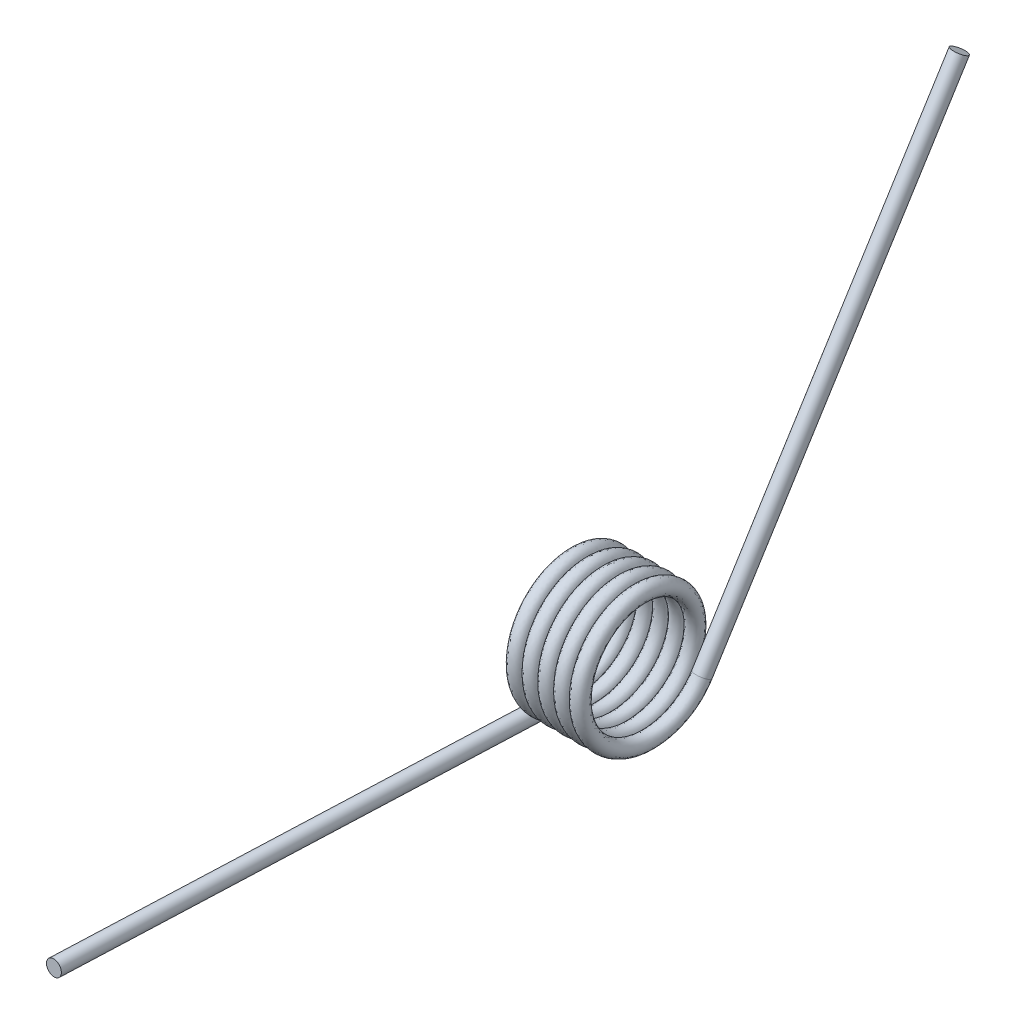
ISO-10303-21;
HEADER;
FILE_DESCRIPTION(('STEP AP214'),'2;1');
FILE_NAME('part.step','',(''),(''),'','','');
FILE_SCHEMA(('AUTOMOTIVE_DESIGN { 1 0 10303 214 1 1 1 1 }'));
ENDSEC;
DATA;
#1=APPLICATION_CONTEXT('core data for automotive mechanical design processes');
#2=APPLICATION_PROTOCOL_DEFINITION('international standard','automotive_design',2000,#1);
#3=PRODUCT_CONTEXT('',#1,'mechanical');
#4=PRODUCT('Part','Part','',(#3));
#5=PRODUCT_RELATED_PRODUCT_CATEGORY('part','',(#4));
#6=PRODUCT_DEFINITION_FORMATION('','',#4);
#7=PRODUCT_DEFINITION_CONTEXT('part definition',#1,'design');
#8=PRODUCT_DEFINITION('design','',#6,#7);
#9=PRODUCT_DEFINITION_SHAPE('','',#8);
#10=(LENGTH_UNIT() NAMED_UNIT(*) SI_UNIT(.MILLI.,.METRE.));
#11=(NAMED_UNIT(*) PLANE_ANGLE_UNIT() SI_UNIT($,.RADIAN.));
#12=(NAMED_UNIT(*) SI_UNIT($,.STERADIAN.) SOLID_ANGLE_UNIT());
#13=UNCERTAINTY_MEASURE_WITH_UNIT(LENGTH_MEASURE(1.E-05),#10,'distance_accuracy_value','');
#14=(GEOMETRIC_REPRESENTATION_CONTEXT(3) GLOBAL_UNCERTAINTY_ASSIGNED_CONTEXT((#13)) GLOBAL_UNIT_ASSIGNED_CONTEXT((#10,
#11,#12)) REPRESENTATION_CONTEXT('',''));
#15=CARTESIAN_POINT('',(0.,0.,0.));
#16=DIRECTION('',(0.,0.,1.));
#17=DIRECTION('',(1.,0.,0.));
#18=AXIS2_PLACEMENT_3D('',#15,#16,#17);
#19=CARTESIAN_POINT('',(-0.799428702759825,-6.3119,-0.0327682651928271));
#20=CARTESIAN_POINT('',(-0.663962036093159,-6.29298123327005,-3.67694542929083));
#21=CARTESIAN_POINT('',(-0.528495369426492,-3.12757184990507,-5.48264987874341));
#22=CARTESIAN_POINT('',(-0.393028702759826,0.0378375334599111,-7.288354328196));
#23=CARTESIAN_POINT('',(-0.25756203609316,3.18432815009493,-5.44988161355059));
#24=CARTESIAN_POINT('',(-0.122095369426493,6.33081876672996,-3.61140889890517));
#25=CARTESIAN_POINT('',(0.0133712972401732,6.3119,0.0327682651928263));
#26=CARTESIAN_POINT('',(0.14883796390684,6.29298123327005,3.67694542929082));
#27=CARTESIAN_POINT('',(0.284304630573506,3.12757184990507,5.48264987874341));
#28=CARTESIAN_POINT('',(0.419771297240172,-0.0378375334599102,7.288354328196));
#29=CARTESIAN_POINT('',(0.555237963906839,-3.18432815009493,5.44988161355059));
#30=CARTESIAN_POINT('',(0.690704630573505,-6.33081876672996,3.61140889890518));
#31=CARTESIAN_POINT('',(0.826171297240171,-6.3119,-0.0327682651928271));
#32=CARTESIAN_POINT('',(0.961637963906838,-6.29298123327005,-3.67694542929083));
#33=CARTESIAN_POINT('',(1.0971046305735,-3.12757184990507,-5.48264987874341));
#34=CARTESIAN_POINT('',(1.23257129724017,0.0378375334599111,-7.288354328196));
#35=CARTESIAN_POINT('',(1.36803796390684,3.18432815009493,-5.44988161355059));
#36=CARTESIAN_POINT('',(1.5035046305735,6.33081876672996,-3.61140889890517));
#37=CARTESIAN_POINT('',(1.63897129724017,6.3119,0.0327682651928263));
#38=CARTESIAN_POINT('',(1.77443796390684,6.29298123327005,3.67694542929082));
#39=CARTESIAN_POINT('',(1.9099046305735,3.12757184990507,5.48264987874341));
#40=CARTESIAN_POINT('',(2.04537129724017,-0.0378375334599102,7.288354328196));
#41=CARTESIAN_POINT('',(2.18083796390684,-3.18432815009493,5.44988161355059));
#42=CARTESIAN_POINT('',(2.3163046305735,-6.33081876672996,3.61140889890518));
#43=CARTESIAN_POINT('',(2.45177129724017,-6.3119,-0.0327682651928271));
#44=CARTESIAN_POINT('',(2.58723796390683,-6.29298123327005,-3.67694542929083));
#45=CARTESIAN_POINT('',(2.7227046305735,-3.12757184990507,-5.48264987874341));
#46=CARTESIAN_POINT('',(2.85817129724017,0.0378375334599111,-7.288354328196));
#47=CARTESIAN_POINT('',(2.99363796390683,3.18432815009493,-5.44988161355059));
#48=CARTESIAN_POINT('',(3.1291046305735,6.33081876672996,-3.61140889890517));
#49=CARTESIAN_POINT('',(3.26457129724017,6.3119,0.0327682651928263));
#50=CARTESIAN_POINT('',(3.40003796390683,6.29298123327005,3.67694542929082));
#51=CARTESIAN_POINT('',(3.5355046305735,3.12757184990507,5.48264987874341));
#52=CARTESIAN_POINT('',(3.67097129724017,-0.0378375334599102,7.288354328196));
#53=CARTESIAN_POINT('',(3.80643796390683,-3.18432815009493,5.44988161355059));
#54=CARTESIAN_POINT('',(3.9419046305735,-6.33081876672996,3.61140889890518));
#55=CARTESIAN_POINT('',(4.07737129724016,-6.3119,-0.0327682651928271));
#56=CARTESIAN_POINT('',(4.21283796390683,-6.29298123327005,-3.67694542929083));
#57=CARTESIAN_POINT('',(4.3483046305735,-3.12757184990507,-5.48264987874341));
#58=CARTESIAN_POINT('',(4.48377129724016,0.0378375334599111,-7.288354328196));
#59=CARTESIAN_POINT('',(4.61923796390683,3.18432815009493,-5.44988161355059));
#60=CARTESIAN_POINT('',(4.7547046305735,6.33081876672996,-3.61140889890517));
#61=CARTESIAN_POINT('',(4.89017129724016,6.3119,0.0327682651928263));
#62=CARTESIAN_POINT('',(5.02563796390683,6.29298123327005,3.67694542929082));
#63=CARTESIAN_POINT('',(5.16110463057349,3.12757184990507,5.48264987874341));
#64=CARTESIAN_POINT('',(5.29657129724016,-0.0378375334599102,7.288354328196));
#65=CARTESIAN_POINT('',(5.43203796390683,-3.18432815009493,5.44988161355059));
#66=CARTESIAN_POINT('',(5.56750463057349,-6.33081876672996,3.61140889890518));
#67=CARTESIAN_POINT('',(5.70297129724016,-6.3119,-0.0327682651928271));
#68=CARTESIAN_POINT('',(5.83843796390683,-6.29298123327005,-3.67694542929083));
#69=CARTESIAN_POINT('',(5.97390463057349,-3.12757184990507,-5.48264987874341));
#70=CARTESIAN_POINT('',(6.10937129724016,0.0378375334599111,-7.288354328196));
#71=CARTESIAN_POINT('',(6.24483796390683,3.18432815009493,-5.44988161355059));
#72=CARTESIAN_POINT('',(6.38030463057349,6.33081876672996,-3.61140889890517));
#73=CARTESIAN_POINT('',(6.51577129724016,6.3119,0.0327682651928263));
#74=CARTESIAN_POINT('',(6.65123796390683,6.29298123327005,3.67694542929082));
#75=CARTESIAN_POINT('',(6.78670463057349,3.12757184990507,5.48264987874341));
#76=CARTESIAN_POINT('',(6.92217129724016,-0.0378375334599102,7.288354328196));
#77=CARTESIAN_POINT('',(7.05763796390682,-3.18432815009493,5.44988161355059));
#78=CARTESIAN_POINT('',(7.19310463057349,-6.33081876672996,3.61140889890518));
#79=CARTESIAN_POINT('',(7.32857129724016,-6.3119,-0.0327682651928271));
#80=CARTESIAN_POINT('',(7.46403796390682,-6.29298123327005,-3.67694542929083));
#81=CARTESIAN_POINT('',(7.59950463057349,-3.12757184990507,-5.48264987874341));
#82=CARTESIAN_POINT('',(7.73497129724015,0.0378375334599111,-7.288354328196));
#83=CARTESIAN_POINT('',(7.87043796390682,3.18432815009493,-5.44988161355059));
#84=CARTESIAN_POINT('',(8.00590463057349,6.33081876672996,-3.61140889890517));
#85=CARTESIAN_POINT('',(8.14137129724015,6.3119,0.0327682651928263));
#86=CARTESIAN_POINT('',(8.27683796390682,6.29298123327005,3.67694542929082));
#87=CARTESIAN_POINT('',(8.41230463057349,3.12757184990507,5.48264987874341));
#88=CARTESIAN_POINT('',(8.54777129724015,-0.0378375334599102,7.288354328196));
#89=CARTESIAN_POINT('',(8.68323796390682,-3.18432815009493,5.44988161355059));
#90=CARTESIAN_POINT('',(8.81870463057349,-6.33081876672996,3.61140889890518));
#91=CARTESIAN_POINT('',(8.95417129724015,-6.3119,-0.0327682651928271));
#92=CARTESIAN_POINT('',(-0.799428702759826,-4.7117,-0.0327682651928087));
#93=CARTESIAN_POINT('',(-0.663962036093159,-4.69278123327006,-2.75306952853357));
#94=CARTESIAN_POINT('',(-0.528495369426493,-2.32747184990508,-4.09683602760755));
#95=CARTESIAN_POINT('',(-0.393028702759827,0.03783753345989,-5.44060252668152));
#96=CARTESIAN_POINT('',(-0.25756203609316,2.38422815009492,-4.06406776241474));
#97=CARTESIAN_POINT('',(-0.122095369426494,4.73061876672995,-2.68753299814795));
#98=CARTESIAN_POINT('',(0.0133712972401724,4.7117,0.0327682651928081));
#99=CARTESIAN_POINT('',(0.148837963906839,4.69278123327006,2.75306952853357));
#100=CARTESIAN_POINT('',(0.284304630573505,2.32747184990509,4.09683602760754));
#101=CARTESIAN_POINT('',(0.419771297240172,-0.0378375334598893,5.44060252668152));
#102=CARTESIAN_POINT('',(0.555237963906838,-2.38422815009492,4.06406776241474));
#103=CARTESIAN_POINT('',(0.690704630573504,-4.73061876672995,2.68753299814795));
#104=CARTESIAN_POINT('',(0.826171297240171,-4.7117,-0.0327682651928087));
#105=CARTESIAN_POINT('',(0.961637963906837,-4.69278123327006,-2.75306952853357));
#106=CARTESIAN_POINT('',(1.0971046305735,-2.32747184990508,-4.09683602760755));
#107=CARTESIAN_POINT('',(1.23257129724017,0.03783753345989,-5.44060252668152));
#108=CARTESIAN_POINT('',(1.36803796390684,2.38422815009492,-4.06406776241474));
#109=CARTESIAN_POINT('',(1.5035046305735,4.73061876672995,-2.68753299814795));
#110=CARTESIAN_POINT('',(1.63897129724017,4.7117,0.0327682651928081));
#111=CARTESIAN_POINT('',(1.77443796390684,4.69278123327006,2.75306952853357));
#112=CARTESIAN_POINT('',(1.9099046305735,2.32747184990509,4.09683602760754));
#113=CARTESIAN_POINT('',(2.04537129724017,-0.0378375334598893,5.44060252668152));
#114=CARTESIAN_POINT('',(2.18083796390683,-2.38422815009492,4.06406776241474));
#115=CARTESIAN_POINT('',(2.3163046305735,-4.73061876672995,2.68753299814795));
#116=CARTESIAN_POINT('',(2.45177129724017,-4.7117,-0.0327682651928087));
#117=CARTESIAN_POINT('',(2.58723796390683,-4.69278123327006,-2.75306952853357));
#118=CARTESIAN_POINT('',(2.7227046305735,-2.32747184990508,-4.09683602760755));
#119=CARTESIAN_POINT('',(2.85817129724017,0.03783753345989,-5.44060252668152));
#120=CARTESIAN_POINT('',(2.99363796390683,2.38422815009492,-4.06406776241474));
#121=CARTESIAN_POINT('',(3.1291046305735,4.73061876672995,-2.68753299814795));
#122=CARTESIAN_POINT('',(3.26457129724017,4.7117,0.0327682651928081));
#123=CARTESIAN_POINT('',(3.40003796390683,4.69278123327006,2.75306952853357));
#124=CARTESIAN_POINT('',(3.5355046305735,2.32747184990509,4.09683602760754));
#125=CARTESIAN_POINT('',(3.67097129724016,-0.0378375334598893,5.44060252668152));
#126=CARTESIAN_POINT('',(3.80643796390683,-2.38422815009492,4.06406776241474));
#127=CARTESIAN_POINT('',(3.9419046305735,-4.73061876672995,2.68753299814795));
#128=CARTESIAN_POINT('',(4.07737129724016,-4.7117,-0.0327682651928087));
#129=CARTESIAN_POINT('',(4.21283796390683,-4.69278123327006,-2.75306952853357));
#130=CARTESIAN_POINT('',(4.3483046305735,-2.32747184990508,-4.09683602760755));
#131=CARTESIAN_POINT('',(4.48377129724016,0.03783753345989,-5.44060252668152));
#132=CARTESIAN_POINT('',(4.61923796390683,2.38422815009492,-4.06406776241474));
#133=CARTESIAN_POINT('',(4.7547046305735,4.73061876672995,-2.68753299814795));
#134=CARTESIAN_POINT('',(4.89017129724016,4.7117,0.0327682651928081));
#135=CARTESIAN_POINT('',(5.02563796390683,4.69278123327006,2.75306952853357));
#136=CARTESIAN_POINT('',(5.16110463057349,2.32747184990509,4.09683602760754));
#137=CARTESIAN_POINT('',(5.29657129724016,-0.0378375334598893,5.44060252668152));
#138=CARTESIAN_POINT('',(5.43203796390683,-2.38422815009492,4.06406776241474));
#139=CARTESIAN_POINT('',(5.56750463057349,-4.73061876672995,2.68753299814795));
#140=CARTESIAN_POINT('',(5.70297129724016,-4.7117,-0.0327682651928087));
#141=CARTESIAN_POINT('',(5.83843796390683,-4.69278123327006,-2.75306952853357));
#142=CARTESIAN_POINT('',(5.97390463057349,-2.32747184990508,-4.09683602760755));
#143=CARTESIAN_POINT('',(6.10937129724016,0.03783753345989,-5.44060252668152));
#144=CARTESIAN_POINT('',(6.24483796390683,2.38422815009492,-4.06406776241474));
#145=CARTESIAN_POINT('',(6.38030463057349,4.73061876672995,-2.68753299814795));
#146=CARTESIAN_POINT('',(6.51577129724016,4.7117,0.0327682651928081));
#147=CARTESIAN_POINT('',(6.65123796390682,4.69278123327006,2.75306952853357));
#148=CARTESIAN_POINT('',(6.78670463057349,2.32747184990509,4.09683602760754));
#149=CARTESIAN_POINT('',(6.92217129724016,-0.0378375334598893,5.44060252668152));
#150=CARTESIAN_POINT('',(7.05763796390682,-2.38422815009492,4.06406776241474));
#151=CARTESIAN_POINT('',(7.19310463057349,-4.73061876672995,2.68753299814795));
#152=CARTESIAN_POINT('',(7.32857129724016,-4.7117,-0.0327682651928087));
#153=CARTESIAN_POINT('',(7.46403796390682,-4.69278123327006,-2.75306952853357));
#154=CARTESIAN_POINT('',(7.59950463057349,-2.32747184990508,-4.09683602760755));
#155=CARTESIAN_POINT('',(7.73497129724016,0.03783753345989,-5.44060252668152));
#156=CARTESIAN_POINT('',(7.87043796390682,2.38422815009492,-4.06406776241474));
#157=CARTESIAN_POINT('',(8.00590463057349,4.73061876672995,-2.68753299814795));
#158=CARTESIAN_POINT('',(8.14137129724015,4.7117,0.0327682651928081));
#159=CARTESIAN_POINT('',(8.27683796390682,4.69278123327006,2.75306952853357));
#160=CARTESIAN_POINT('',(8.41230463057349,2.32747184990509,4.09683602760754));
#161=CARTESIAN_POINT('',(8.54777129724015,-0.0378375334598893,5.44060252668152));
#162=CARTESIAN_POINT('',(8.68323796390682,-2.38422815009492,4.06406776241474));
#163=CARTESIAN_POINT('',(8.81870463057349,-4.73061876672995,2.68753299814795));
#164=CARTESIAN_POINT('',(8.95417129724015,-4.7117,-0.0327682651928087));
#165=CARTESIAN_POINT('',(0.799428702759824,-4.7117,0.0327682651927133));
#166=CARTESIAN_POINT('',(0.934895369426491,-4.73061876672989,-2.68753299814805));
#167=CARTESIAN_POINT('',(1.07036203609316,-2.38422815009484,-4.06406776241478));
#168=CARTESIAN_POINT('',(1.20582870275982,-0.0378375334597805,-5.44060252668152));
#169=CARTESIAN_POINT('',(1.34129536942649,2.32747184990516,-4.0968360276075));
#170=CARTESIAN_POINT('',(1.47676203609316,4.69278123327011,-2.75306952853348));
#171=CARTESIAN_POINT('',(1.61222870275982,4.7117,-0.0327682651927139));
#172=CARTESIAN_POINT('',(1.74769536942649,4.73061876672989,2.68753299814805));
#173=CARTESIAN_POINT('',(1.88316203609316,2.38422815009484,4.06406776241478));
#174=CARTESIAN_POINT('',(2.01862870275982,0.0378375334597811,5.44060252668152));
#175=CARTESIAN_POINT('',(2.15409536942649,-2.32747184990516,4.0968360276075));
#176=CARTESIAN_POINT('',(2.28956203609315,-4.69278123327011,2.75306952853348));
#177=CARTESIAN_POINT('',(2.42502870275982,-4.7117,0.0327682651927133));
#178=CARTESIAN_POINT('',(2.56049536942649,-4.73061876672989,-2.68753299814805));
#179=CARTESIAN_POINT('',(2.69596203609315,-2.38422815009484,-4.06406776241478));
#180=CARTESIAN_POINT('',(2.83142870275982,-0.0378375334597805,-5.44060252668152));
#181=CARTESIAN_POINT('',(2.96689536942649,2.32747184990516,-4.0968360276075));
#182=CARTESIAN_POINT('',(3.10236203609315,4.69278123327011,-2.75306952853348));
#183=CARTESIAN_POINT('',(3.23782870275982,4.7117,-0.0327682651927139));
#184=CARTESIAN_POINT('',(3.37329536942649,4.73061876672989,2.68753299814805));
#185=CARTESIAN_POINT('',(3.50876203609315,2.38422815009484,4.06406776241478));
#186=CARTESIAN_POINT('',(3.64422870275982,0.0378375334597811,5.44060252668152));
#187=CARTESIAN_POINT('',(3.77969536942648,-2.32747184990516,4.0968360276075));
#188=CARTESIAN_POINT('',(3.91516203609315,-4.69278123327011,2.75306952853348));
#189=CARTESIAN_POINT('',(4.05062870275982,-4.7117,0.0327682651927133));
#190=CARTESIAN_POINT('',(4.18609536942648,-4.73061876672989,-2.68753299814805));
#191=CARTESIAN_POINT('',(4.32156203609315,-2.38422815009484,-4.06406776241478));
#192=CARTESIAN_POINT('',(4.45702870275982,-0.0378375334597805,-5.44060252668152));
#193=CARTESIAN_POINT('',(4.59249536942648,2.32747184990516,-4.0968360276075));
#194=CARTESIAN_POINT('',(4.72796203609315,4.69278123327011,-2.75306952853348));
#195=CARTESIAN_POINT('',(4.86342870275982,4.7117,-0.0327682651927139));
#196=CARTESIAN_POINT('',(4.99889536942648,4.73061876672989,2.68753299814805));
#197=CARTESIAN_POINT('',(5.13436203609315,2.38422815009484,4.06406776241478));
#198=CARTESIAN_POINT('',(5.26982870275981,0.0378375334597811,5.44060252668152));
#199=CARTESIAN_POINT('',(5.40529536942648,-2.32747184990516,4.0968360276075));
#200=CARTESIAN_POINT('',(5.54076203609315,-4.69278123327011,2.75306952853348));
#201=CARTESIAN_POINT('',(5.67622870275981,-4.7117,0.0327682651927133));
#202=CARTESIAN_POINT('',(5.81169536942648,-4.73061876672989,-2.68753299814805));
#203=CARTESIAN_POINT('',(5.94716203609315,-2.38422815009484,-4.06406776241478));
#204=CARTESIAN_POINT('',(6.08262870275981,-0.0378375334597805,-5.44060252668152));
#205=CARTESIAN_POINT('',(6.21809536942648,2.32747184990516,-4.0968360276075));
#206=CARTESIAN_POINT('',(6.35356203609315,4.69278123327011,-2.75306952853348));
#207=CARTESIAN_POINT('',(6.48902870275981,4.7117,-0.0327682651927139));
#208=CARTESIAN_POINT('',(6.62449536942648,4.73061876672989,2.68753299814805));
#209=CARTESIAN_POINT('',(6.75996203609314,2.38422815009484,4.06406776241478));
#210=CARTESIAN_POINT('',(6.89542870275981,0.0378375334597811,5.44060252668152));
#211=CARTESIAN_POINT('',(7.03089536942648,-2.32747184990516,4.0968360276075));
#212=CARTESIAN_POINT('',(7.16636203609314,-4.69278123327011,2.75306952853348));
#213=CARTESIAN_POINT('',(7.30182870275981,-4.7117,0.0327682651927133));
#214=CARTESIAN_POINT('',(7.43729536942648,-4.73061876672989,-2.68753299814805));
#215=CARTESIAN_POINT('',(7.57276203609314,-2.38422815009484,-4.06406776241478));
#216=CARTESIAN_POINT('',(7.70822870275981,-0.0378375334597805,-5.44060252668152));
#217=CARTESIAN_POINT('',(7.84369536942647,2.32747184990516,-4.0968360276075));
#218=CARTESIAN_POINT('',(7.97916203609314,4.69278123327011,-2.75306952853348));
#219=CARTESIAN_POINT('',(8.11462870275981,4.7117,-0.0327682651927139));
#220=CARTESIAN_POINT('',(8.25009536942648,4.73061876672989,2.68753299814805));
#221=CARTESIAN_POINT('',(8.38556203609314,2.38422815009484,4.06406776241478));
#222=CARTESIAN_POINT('',(8.52102870275981,0.0378375334597811,5.44060252668152));
#223=CARTESIAN_POINT('',(8.65649536942647,-2.32747184990516,4.0968360276075));
#224=CARTESIAN_POINT('',(8.79196203609314,-4.69278123327011,2.75306952853348));
#225=CARTESIAN_POINT('',(8.92742870275981,-4.7117,0.0327682651927133));
#226=CARTESIAN_POINT('',(9.06289536942647,-4.73061876672989,-2.68753299814805));
#227=CARTESIAN_POINT('',(9.19836203609314,-2.38422815009484,-4.06406776241478));
#228=CARTESIAN_POINT('',(9.33382870275981,-0.0378375334597805,-5.44060252668152));
#229=CARTESIAN_POINT('',(9.46929536942647,2.32747184990516,-4.0968360276075));
#230=CARTESIAN_POINT('',(9.60476203609314,4.69278123327011,-2.75306952853348));
#231=CARTESIAN_POINT('',(9.7402287027598,4.7117,-0.0327682651927139));
#232=CARTESIAN_POINT('',(9.87569536942647,4.73061876672989,2.68753299814805));
#233=CARTESIAN_POINT('',(10.0111620360931,2.38422815009484,4.06406776241478));
#234=CARTESIAN_POINT('',(10.1466287027598,0.0378375334597811,5.44060252668152));
#235=CARTESIAN_POINT('',(10.2820953694265,-2.32747184990516,4.0968360276075));
#236=CARTESIAN_POINT('',(10.4175620360931,-4.69278123327011,2.75306952853348));
#237=CARTESIAN_POINT('',(10.5530287027598,-4.7117,0.0327682651927133));
#238=CARTESIAN_POINT('',(0.799428702759825,-6.3119,0.0327682651926949));
#239=CARTESIAN_POINT('',(0.934895369426492,-6.33081876672988,-3.6114088989053));
#240=CARTESIAN_POINT('',(1.07036203609316,-3.18432815009482,-5.44988161355065));
#241=CARTESIAN_POINT('',(1.20582870275982,-0.0378375334597593,-7.288354328196));
#242=CARTESIAN_POINT('',(1.34129536942649,3.12757184990518,-5.48264987874335));
#243=CARTESIAN_POINT('',(1.47676203609316,6.29298123327012,-3.6769454292907));
#244=CARTESIAN_POINT('',(1.61222870275982,6.3119,-0.0327682651926957));
#245=CARTESIAN_POINT('',(1.74769536942649,6.33081876672988,3.6114088989053));
#246=CARTESIAN_POINT('',(1.88316203609316,3.18432815009482,5.44988161355065));
#247=CARTESIAN_POINT('',(2.01862870275982,0.0378375334597602,7.288354328196));
#248=CARTESIAN_POINT('',(2.15409536942649,-3.12757184990518,5.48264987874335));
#249=CARTESIAN_POINT('',(2.28956203609316,-6.29298123327012,3.6769454292907));
#250=CARTESIAN_POINT('',(2.42502870275982,-6.3119,0.0327682651926949));
#251=CARTESIAN_POINT('',(2.56049536942649,-6.33081876672988,-3.6114088989053));
#252=CARTESIAN_POINT('',(2.69596203609315,-3.18432815009482,-5.44988161355065));
#253=CARTESIAN_POINT('',(2.83142870275982,-0.0378375334597593,-7.288354328196));
#254=CARTESIAN_POINT('',(2.96689536942649,3.12757184990518,-5.48264987874335));
#255=CARTESIAN_POINT('',(3.10236203609315,6.29298123327012,-3.6769454292907));
#256=CARTESIAN_POINT('',(3.23782870275982,6.3119,-0.0327682651926957));
#257=CARTESIAN_POINT('',(3.37329536942649,6.33081876672988,3.6114088989053));
#258=CARTESIAN_POINT('',(3.50876203609315,3.18432815009482,5.44988161355065));
#259=CARTESIAN_POINT('',(3.64422870275982,0.0378375334597602,7.288354328196));
#260=CARTESIAN_POINT('',(3.77969536942649,-3.12757184990518,5.48264987874335));
#261=CARTESIAN_POINT('',(3.91516203609315,-6.29298123327012,3.6769454292907));
#262=CARTESIAN_POINT('',(4.05062870275982,-6.3119,0.0327682651926949));
#263=CARTESIAN_POINT('',(4.18609536942648,-6.33081876672988,-3.6114088989053));
#264=CARTESIAN_POINT('',(4.32156203609315,-3.18432815009482,-5.44988161355065));
#265=CARTESIAN_POINT('',(4.45702870275982,-0.0378375334597593,-7.288354328196));
#266=CARTESIAN_POINT('',(4.59249536942648,3.12757184990518,-5.48264987874335));
#267=CARTESIAN_POINT('',(4.72796203609315,6.29298123327012,-3.6769454292907));
#268=CARTESIAN_POINT('',(4.86342870275982,6.3119,-0.0327682651926957));
#269=CARTESIAN_POINT('',(4.99889536942648,6.33081876672988,3.6114088989053));
#270=CARTESIAN_POINT('',(5.13436203609315,3.18432815009482,5.44988161355065));
#271=CARTESIAN_POINT('',(5.26982870275981,0.0378375334597602,7.288354328196));
#272=CARTESIAN_POINT('',(5.40529536942648,-3.12757184990518,5.48264987874335));
#273=CARTESIAN_POINT('',(5.54076203609315,-6.29298123327012,3.6769454292907));
#274=CARTESIAN_POINT('',(5.67622870275981,-6.3119,0.0327682651926949));
#275=CARTESIAN_POINT('',(5.81169536942648,-6.33081876672988,-3.6114088989053));
#276=CARTESIAN_POINT('',(5.94716203609315,-3.18432815009482,-5.44988161355065));
#277=CARTESIAN_POINT('',(6.08262870275981,-0.0378375334597593,-7.288354328196));
#278=CARTESIAN_POINT('',(6.21809536942648,3.12757184990518,-5.48264987874335));
#279=CARTESIAN_POINT('',(6.35356203609315,6.29298123327012,-3.6769454292907));
#280=CARTESIAN_POINT('',(6.48902870275981,6.3119,-0.0327682651926957));
#281=CARTESIAN_POINT('',(6.62449536942648,6.33081876672988,3.6114088989053));
#282=CARTESIAN_POINT('',(6.75996203609315,3.18432815009482,5.44988161355065));
#283=CARTESIAN_POINT('',(6.89542870275981,0.0378375334597602,7.288354328196));
#284=CARTESIAN_POINT('',(7.03089536942648,-3.12757184990518,5.48264987874335));
#285=CARTESIAN_POINT('',(7.16636203609314,-6.29298123327012,3.6769454292907));
#286=CARTESIAN_POINT('',(7.30182870275981,-6.3119,0.0327682651926949));
#287=CARTESIAN_POINT('',(7.43729536942648,-6.33081876672988,-3.6114088989053));
#288=CARTESIAN_POINT('',(7.57276203609314,-3.18432815009482,-5.44988161355065));
#289=CARTESIAN_POINT('',(7.70822870275981,-0.0378375334597593,-7.288354328196));
#290=CARTESIAN_POINT('',(7.84369536942648,3.12757184990518,-5.48264987874335));
#291=CARTESIAN_POINT('',(7.97916203609314,6.29298123327012,-3.6769454292907));
#292=CARTESIAN_POINT('',(8.11462870275981,6.3119,-0.0327682651926957));
#293=CARTESIAN_POINT('',(8.25009536942648,6.33081876672988,3.6114088989053));
#294=CARTESIAN_POINT('',(8.38556203609314,3.18432815009482,5.44988161355065));
#295=CARTESIAN_POINT('',(8.52102870275981,0.0378375334597602,7.288354328196));
#296=CARTESIAN_POINT('',(8.65649536942647,-3.12757184990518,5.48264987874335));
#297=CARTESIAN_POINT('',(8.79196203609314,-6.29298123327012,3.6769454292907));
#298=CARTESIAN_POINT('',(8.92742870275981,-6.3119,0.0327682651926949));
#299=CARTESIAN_POINT('',(9.06289536942647,-6.33081876672988,-3.6114088989053));
#300=CARTESIAN_POINT('',(9.19836203609314,-3.18432815009482,-5.44988161355065));
#301=CARTESIAN_POINT('',(9.33382870275981,-0.0378375334597593,-7.288354328196));
#302=CARTESIAN_POINT('',(9.46929536942647,3.12757184990518,-5.48264987874335));
#303=CARTESIAN_POINT('',(9.60476203609314,6.29298123327012,-3.6769454292907));
#304=CARTESIAN_POINT('',(9.74022870275981,6.3119,-0.0327682651926957));
#305=CARTESIAN_POINT('',(9.87569536942647,6.33081876672988,3.6114088989053));
#306=CARTESIAN_POINT('',(10.0111620360931,3.18432815009482,5.44988161355065));
#307=CARTESIAN_POINT('',(10.1466287027598,0.0378375334597602,7.288354328196));
#308=CARTESIAN_POINT('',(10.2820953694265,-3.12757184990518,5.48264987874335));
#309=CARTESIAN_POINT('',(10.4175620360931,-6.29298123327012,3.6769454292907));
#310=CARTESIAN_POINT('',(10.5530287027598,-6.3119,0.0327682651926949));
#311=CARTESIAN_POINT('',(0.799428702759826,-7.9121,0.0327682651926765));
#312=CARTESIAN_POINT('',(0.934895369426493,-7.93101876672987,-4.53528479966256));
#313=CARTESIAN_POINT('',(1.07036203609316,-3.9844281500948,-6.83569546468652));
#314=CARTESIAN_POINT('',(1.20582870275983,-0.0378375334597382,-9.13610612971048));
#315=CARTESIAN_POINT('',(1.34129536942649,3.9276718499052,-6.8684637298792));
#316=CARTESIAN_POINT('',(1.47676203609316,7.89318123327013,-4.60082133004792));
#317=CARTESIAN_POINT('',(1.61222870275982,7.9121,-0.0327682651926775));
#318=CARTESIAN_POINT('',(1.74769536942649,7.93101876672987,4.53528479966256));
#319=CARTESIAN_POINT('',(1.88316203609316,3.98442815009481,6.83569546468652));
#320=CARTESIAN_POINT('',(2.01862870275982,0.0378375334597393,9.13610612971048));
#321=CARTESIAN_POINT('',(2.15409536942649,-3.92767184990519,6.8684637298792));
#322=CARTESIAN_POINT('',(2.28956203609316,-7.89318123327013,4.60082133004792));
#323=CARTESIAN_POINT('',(2.42502870275982,-7.9121,0.0327682651926765));
#324=CARTESIAN_POINT('',(2.56049536942649,-7.93101876672987,-4.53528479966256));
#325=CARTESIAN_POINT('',(2.69596203609315,-3.9844281500948,-6.83569546468652));
#326=CARTESIAN_POINT('',(2.83142870275982,-0.0378375334597382,-9.13610612971048));
#327=CARTESIAN_POINT('',(2.96689536942649,3.9276718499052,-6.8684637298792));
#328=CARTESIAN_POINT('',(3.10236203609315,7.89318123327013,-4.60082133004792));
#329=CARTESIAN_POINT('',(3.23782870275982,7.9121,-0.0327682651926775));
#330=CARTESIAN_POINT('',(3.37329536942649,7.93101876672987,4.53528479966256));
#331=CARTESIAN_POINT('',(3.50876203609315,3.98442815009481,6.83569546468652));
#332=CARTESIAN_POINT('',(3.64422870275982,0.0378375334597393,9.13610612971048));
#333=CARTESIAN_POINT('',(3.77969536942649,-3.92767184990519,6.8684637298792));
#334=CARTESIAN_POINT('',(3.91516203609315,-7.89318123327013,4.60082133004792));
#335=CARTESIAN_POINT('',(4.05062870275982,-7.9121,0.0327682651926765));
#336=CARTESIAN_POINT('',(4.18609536942648,-7.93101876672987,-4.53528479966256));
#337=CARTESIAN_POINT('',(4.32156203609315,-3.9844281500948,-6.83569546468652));
#338=CARTESIAN_POINT('',(4.45702870275982,-0.0378375334597382,-9.13610612971048));
#339=CARTESIAN_POINT('',(4.59249536942648,3.9276718499052,-6.8684637298792));
#340=CARTESIAN_POINT('',(4.72796203609315,7.89318123327013,-4.60082133004792));
#341=CARTESIAN_POINT('',(4.86342870275982,7.9121,-0.0327682651926775));
#342=CARTESIAN_POINT('',(4.99889536942649,7.93101876672987,4.53528479966256));
#343=CARTESIAN_POINT('',(5.13436203609315,3.98442815009481,6.83569546468652));
#344=CARTESIAN_POINT('',(5.26982870275982,0.0378375334597393,9.13610612971048));
#345=CARTESIAN_POINT('',(5.40529536942648,-3.92767184990519,6.8684637298792));
#346=CARTESIAN_POINT('',(5.54076203609315,-7.89318123327013,4.60082133004792));
#347=CARTESIAN_POINT('',(5.67622870275982,-7.9121,0.0327682651926765));
#348=CARTESIAN_POINT('',(5.81169536942648,-7.93101876672987,-4.53528479966256));
#349=CARTESIAN_POINT('',(5.94716203609315,-3.9844281500948,-6.83569546468652));
#350=CARTESIAN_POINT('',(6.08262870275981,-0.0378375334597382,-9.13610612971048));
#351=CARTESIAN_POINT('',(6.21809536942648,3.9276718499052,-6.8684637298792));
#352=CARTESIAN_POINT('',(6.35356203609315,7.89318123327013,-4.60082133004792));
#353=CARTESIAN_POINT('',(6.48902870275981,7.9121,-0.0327682651926775));
#354=CARTESIAN_POINT('',(6.62449536942648,7.93101876672987,4.53528479966256));
#355=CARTESIAN_POINT('',(6.75996203609315,3.98442815009481,6.83569546468652));
#356=CARTESIAN_POINT('',(6.89542870275981,0.0378375334597393,9.13610612971048));
#357=CARTESIAN_POINT('',(7.03089536942648,-3.92767184990519,6.8684637298792));
#358=CARTESIAN_POINT('',(7.16636203609315,-7.89318123327013,4.60082133004792));
#359=CARTESIAN_POINT('',(7.30182870275981,-7.9121,0.0327682651926765));
#360=CARTESIAN_POINT('',(7.43729536942648,-7.93101876672987,-4.53528479966256));
#361=CARTESIAN_POINT('',(7.57276203609315,-3.9844281500948,-6.83569546468652));
#362=CARTESIAN_POINT('',(7.70822870275981,-0.0378375334597382,-9.13610612971048));
#363=CARTESIAN_POINT('',(7.84369536942648,3.9276718499052,-6.8684637298792));
#364=CARTESIAN_POINT('',(7.97916203609314,7.89318123327013,-4.60082133004792));
#365=CARTESIAN_POINT('',(8.11462870275981,7.9121,-0.0327682651926775));
#366=CARTESIAN_POINT('',(8.25009536942648,7.93101876672987,4.53528479966256));
#367=CARTESIAN_POINT('',(8.38556203609314,3.98442815009481,6.83569546468652));
#368=CARTESIAN_POINT('',(8.52102870275981,0.0378375334597393,9.13610612971048));
#369=CARTESIAN_POINT('',(8.65649536942647,-3.92767184990519,6.8684637298792));
#370=CARTESIAN_POINT('',(8.79196203609314,-7.89318123327013,4.60082133004792));
#371=CARTESIAN_POINT('',(8.92742870275981,-7.9121,0.0327682651926765));
#372=CARTESIAN_POINT('',(9.06289536942647,-7.93101876672987,-4.53528479966256));
#373=CARTESIAN_POINT('',(9.19836203609314,-3.9844281500948,-6.83569546468652));
#374=CARTESIAN_POINT('',(9.33382870275981,-0.0378375334597382,-9.13610612971048));
#375=CARTESIAN_POINT('',(9.46929536942647,3.9276718499052,-6.8684637298792));
#376=CARTESIAN_POINT('',(9.60476203609314,7.89318123327013,-4.60082133004792));
#377=CARTESIAN_POINT('',(9.74022870275981,7.9121,-0.0327682651926775));
#378=CARTESIAN_POINT('',(9.87569536942647,7.93101876672987,4.53528479966256));
#379=CARTESIAN_POINT('',(10.0111620360931,3.98442815009481,6.83569546468652));
#380=CARTESIAN_POINT('',(10.1466287027598,0.0378375334597393,9.13610612971048));
#381=CARTESIAN_POINT('',(10.2820953694265,-3.92767184990519,6.8684637298792));
#382=CARTESIAN_POINT('',(10.4175620360931,-7.89318123327013,4.60082133004792));
#383=CARTESIAN_POINT('',(10.5530287027598,-7.9121,0.0327682651926765));
#384=CARTESIAN_POINT('',(-0.799428702759824,-7.9121,-0.0327682651928455));
#385=CARTESIAN_POINT('',(-0.663962036093158,-7.89318123327004,-4.60082133004808));
#386=CARTESIAN_POINT('',(-0.528495369426492,-3.92767184990505,-6.86846372987928));
#387=CARTESIAN_POINT('',(-0.393028702759825,0.0378375334599323,-9.13610612971048));
#388=CARTESIAN_POINT('',(-0.257562036093159,3.98442815009495,-6.83569546468644));
#389=CARTESIAN_POINT('',(-0.122095369426492,7.93101876672997,-4.5352847996624));
#390=CARTESIAN_POINT('',(0.0133712972401739,7.9121,0.0327682651928446));
#391=CARTESIAN_POINT('',(0.14883796390684,7.89318123327004,4.60082133004808));
#392=CARTESIAN_POINT('',(0.284304630573507,3.92767184990505,6.86846372987928));
#393=CARTESIAN_POINT('',(0.419771297240173,-0.0378375334599311,9.13610612971048));
#394=CARTESIAN_POINT('',(0.555237963906839,-3.98442815009494,6.83569546468644));
#395=CARTESIAN_POINT('',(0.690704630573506,-7.93101876672996,4.5352847996624));
#396=CARTESIAN_POINT('',(0.826171297240172,-7.9121,-0.0327682651928455));
#397=CARTESIAN_POINT('',(0.961637963906838,-7.89318123327004,-4.60082133004808));
#398=CARTESIAN_POINT('',(1.0971046305735,-3.92767184990505,-6.86846372987928));
#399=CARTESIAN_POINT('',(1.23257129724017,0.0378375334599323,-9.13610612971048));
#400=CARTESIAN_POINT('',(1.36803796390684,3.98442815009495,-6.83569546468644));
#401=CARTESIAN_POINT('',(1.5035046305735,7.93101876672997,-4.5352847996624));
#402=CARTESIAN_POINT('',(1.63897129724017,7.9121,0.0327682651928446));
#403=CARTESIAN_POINT('',(1.77443796390684,7.89318123327004,4.60082133004808));
#404=CARTESIAN_POINT('',(1.9099046305735,3.92767184990505,6.86846372987928));
#405=CARTESIAN_POINT('',(2.04537129724017,-0.0378375334599311,9.13610612971048));
#406=CARTESIAN_POINT('',(2.18083796390684,-3.98442815009494,6.83569546468644));
#407=CARTESIAN_POINT('',(2.3163046305735,-7.93101876672996,4.5352847996624));
#408=CARTESIAN_POINT('',(2.45177129724017,-7.9121,-0.0327682651928455));
#409=CARTESIAN_POINT('',(2.58723796390684,-7.89318123327004,-4.60082133004808));
#410=CARTESIAN_POINT('',(2.7227046305735,-3.92767184990505,-6.86846372987928));
#411=CARTESIAN_POINT('',(2.85817129724017,0.0378375334599323,-9.13610612971048));
#412=CARTESIAN_POINT('',(2.99363796390683,3.98442815009495,-6.83569546468644));
#413=CARTESIAN_POINT('',(3.1291046305735,7.93101876672997,-4.5352847996624));
#414=CARTESIAN_POINT('',(3.26457129724017,7.9121,0.0327682651928446));
#415=CARTESIAN_POINT('',(3.40003796390683,7.89318123327004,4.60082133004808));
#416=CARTESIAN_POINT('',(3.5355046305735,3.92767184990505,6.86846372987928));
#417=CARTESIAN_POINT('',(3.67097129724017,-0.0378375334599311,9.13610612971048));
#418=CARTESIAN_POINT('',(3.80643796390683,-3.98442815009494,6.83569546468644));
#419=CARTESIAN_POINT('',(3.9419046305735,-7.93101876672996,4.5352847996624));
#420=CARTESIAN_POINT('',(4.07737129724016,-7.9121,-0.0327682651928455));
#421=CARTESIAN_POINT('',(4.21283796390683,-7.89318123327004,-4.60082133004808));
#422=CARTESIAN_POINT('',(4.3483046305735,-3.92767184990505,-6.86846372987928));
#423=CARTESIAN_POINT('',(4.48377129724016,0.0378375334599323,-9.13610612971048));
#424=CARTESIAN_POINT('',(4.61923796390683,3.98442815009495,-6.83569546468644));
#425=CARTESIAN_POINT('',(4.7547046305735,7.93101876672997,-4.5352847996624));
#426=CARTESIAN_POINT('',(4.89017129724016,7.9121,0.0327682651928446));
#427=CARTESIAN_POINT('',(5.02563796390683,7.89318123327004,4.60082133004808));
#428=CARTESIAN_POINT('',(5.1611046305735,3.92767184990505,6.86846372987928));
#429=CARTESIAN_POINT('',(5.29657129724016,-0.0378375334599311,9.13610612971048));
#430=CARTESIAN_POINT('',(5.43203796390683,-3.98442815009494,6.83569546468644));
#431=CARTESIAN_POINT('',(5.5675046305735,-7.93101876672996,4.5352847996624));
#432=CARTESIAN_POINT('',(5.70297129724016,-7.9121,-0.0327682651928455));
#433=CARTESIAN_POINT('',(5.83843796390683,-7.89318123327004,-4.60082133004808));
#434=CARTESIAN_POINT('',(5.97390463057349,-3.92767184990505,-6.86846372987928));
#435=CARTESIAN_POINT('',(6.10937129724016,0.0378375334599323,-9.13610612971048));
#436=CARTESIAN_POINT('',(6.24483796390683,3.98442815009495,-6.83569546468644));
#437=CARTESIAN_POINT('',(6.38030463057349,7.93101876672997,-4.5352847996624));
#438=CARTESIAN_POINT('',(6.51577129724016,7.9121,0.0327682651928446));
#439=CARTESIAN_POINT('',(6.65123796390683,7.89318123327004,4.60082133004808));
#440=CARTESIAN_POINT('',(6.78670463057349,3.92767184990505,6.86846372987928));
#441=CARTESIAN_POINT('',(6.92217129724016,-0.0378375334599311,9.13610612971048));
#442=CARTESIAN_POINT('',(7.05763796390682,-3.98442815009494,6.83569546468644));
#443=CARTESIAN_POINT('',(7.19310463057349,-7.93101876672996,4.5352847996624));
#444=CARTESIAN_POINT('',(7.32857129724016,-7.9121,-0.0327682651928455));
#445=CARTESIAN_POINT('',(7.46403796390682,-7.89318123327004,-4.60082133004808));
#446=CARTESIAN_POINT('',(7.59950463057349,-3.92767184990505,-6.86846372987928));
#447=CARTESIAN_POINT('',(7.73497129724016,0.0378375334599323,-9.13610612971048));
#448=CARTESIAN_POINT('',(7.87043796390682,3.98442815009495,-6.83569546468644));
#449=CARTESIAN_POINT('',(8.00590463057349,7.93101876672997,-4.5352847996624));
#450=CARTESIAN_POINT('',(8.14137129724016,7.9121,0.0327682651928446));
#451=CARTESIAN_POINT('',(8.27683796390682,7.89318123327004,4.60082133004808));
#452=CARTESIAN_POINT('',(8.41230463057349,3.92767184990505,6.86846372987928));
#453=CARTESIAN_POINT('',(8.54777129724016,-0.0378375334599311,9.13610612971048));
#454=CARTESIAN_POINT('',(8.68323796390682,-3.98442815009494,6.83569546468644));
#455=CARTESIAN_POINT('',(8.81870463057349,-7.93101876672996,4.5352847996624));
#456=CARTESIAN_POINT('',(8.95417129724015,-7.9121,-0.0327682651928455));
#457=CARTESIAN_POINT('',(-0.799428702759825,-6.3119,-0.0327682651928271));
#458=CARTESIAN_POINT('',(-0.663962036093159,-6.29298123327005,-3.67694542929083));
#459=CARTESIAN_POINT('',(-0.528495369426492,-3.12757184990507,-5.48264987874341));
#460=CARTESIAN_POINT('',(-0.393028702759826,0.0378375334599111,-7.288354328196));
#461=CARTESIAN_POINT('',(-0.25756203609316,3.18432815009493,-5.44988161355059));
#462=CARTESIAN_POINT('',(-0.122095369426493,6.33081876672996,-3.61140889890517));
#463=CARTESIAN_POINT('',(0.0133712972401732,6.3119,0.0327682651928263));
#464=CARTESIAN_POINT('',(0.14883796390684,6.29298123327005,3.67694542929082));
#465=CARTESIAN_POINT('',(0.284304630573506,3.12757184990507,5.48264987874341));
#466=CARTESIAN_POINT('',(0.419771297240172,-0.0378375334599102,7.288354328196));
#467=CARTESIAN_POINT('',(0.555237963906839,-3.18432815009493,5.44988161355059));
#468=CARTESIAN_POINT('',(0.690704630573505,-6.33081876672996,3.61140889890518));
#469=CARTESIAN_POINT('',(0.826171297240171,-6.3119,-0.0327682651928271));
#470=CARTESIAN_POINT('',(0.961637963906838,-6.29298123327005,-3.67694542929083));
#471=CARTESIAN_POINT('',(1.0971046305735,-3.12757184990507,-5.48264987874341));
#472=CARTESIAN_POINT('',(1.23257129724017,0.0378375334599111,-7.288354328196));
#473=CARTESIAN_POINT('',(1.36803796390684,3.18432815009493,-5.44988161355059));
#474=CARTESIAN_POINT('',(1.5035046305735,6.33081876672996,-3.61140889890517));
#475=CARTESIAN_POINT('',(1.63897129724017,6.3119,0.0327682651928263));
#476=CARTESIAN_POINT('',(1.77443796390684,6.29298123327005,3.67694542929082));
#477=CARTESIAN_POINT('',(1.9099046305735,3.12757184990507,5.48264987874341));
#478=CARTESIAN_POINT('',(2.04537129724017,-0.0378375334599102,7.288354328196));
#479=CARTESIAN_POINT('',(2.18083796390684,-3.18432815009493,5.44988161355059));
#480=CARTESIAN_POINT('',(2.3163046305735,-6.33081876672996,3.61140889890518));
#481=CARTESIAN_POINT('',(2.45177129724017,-6.3119,-0.0327682651928271));
#482=CARTESIAN_POINT('',(2.58723796390683,-6.29298123327005,-3.67694542929083));
#483=CARTESIAN_POINT('',(2.7227046305735,-3.12757184990507,-5.48264987874341));
#484=CARTESIAN_POINT('',(2.85817129724017,0.0378375334599111,-7.288354328196));
#485=CARTESIAN_POINT('',(2.99363796390683,3.18432815009493,-5.44988161355059));
#486=CARTESIAN_POINT('',(3.1291046305735,6.33081876672996,-3.61140889890517));
#487=CARTESIAN_POINT('',(3.26457129724017,6.3119,0.0327682651928263));
#488=CARTESIAN_POINT('',(3.40003796390683,6.29298123327005,3.67694542929082));
#489=CARTESIAN_POINT('',(3.5355046305735,3.12757184990507,5.48264987874341));
#490=CARTESIAN_POINT('',(3.67097129724017,-0.0378375334599102,7.288354328196));
#491=CARTESIAN_POINT('',(3.80643796390683,-3.18432815009493,5.44988161355059));
#492=CARTESIAN_POINT('',(3.9419046305735,-6.33081876672996,3.61140889890518));
#493=CARTESIAN_POINT('',(4.07737129724016,-6.3119,-0.0327682651928271));
#494=CARTESIAN_POINT('',(4.21283796390683,-6.29298123327005,-3.67694542929083));
#495=CARTESIAN_POINT('',(4.3483046305735,-3.12757184990507,-5.48264987874341));
#496=CARTESIAN_POINT('',(4.48377129724016,0.0378375334599111,-7.288354328196));
#497=CARTESIAN_POINT('',(4.61923796390683,3.18432815009493,-5.44988161355059));
#498=CARTESIAN_POINT('',(4.7547046305735,6.33081876672996,-3.61140889890517));
#499=CARTESIAN_POINT('',(4.89017129724016,6.3119,0.0327682651928263));
#500=CARTESIAN_POINT('',(5.02563796390683,6.29298123327005,3.67694542929082));
#501=CARTESIAN_POINT('',(5.16110463057349,3.12757184990507,5.48264987874341));
#502=CARTESIAN_POINT('',(5.29657129724016,-0.0378375334599102,7.288354328196));
#503=CARTESIAN_POINT('',(5.43203796390683,-3.18432815009493,5.44988161355059));
#504=CARTESIAN_POINT('',(5.56750463057349,-6.33081876672996,3.61140889890518));
#505=CARTESIAN_POINT('',(5.70297129724016,-6.3119,-0.0327682651928271));
#506=CARTESIAN_POINT('',(5.83843796390683,-6.29298123327005,-3.67694542929083));
#507=CARTESIAN_POINT('',(5.97390463057349,-3.12757184990507,-5.48264987874341));
#508=CARTESIAN_POINT('',(6.10937129724016,0.0378375334599111,-7.288354328196));
#509=CARTESIAN_POINT('',(6.24483796390683,3.18432815009493,-5.44988161355059));
#510=CARTESIAN_POINT('',(6.38030463057349,6.33081876672996,-3.61140889890517));
#511=CARTESIAN_POINT('',(6.51577129724016,6.3119,0.0327682651928263));
#512=CARTESIAN_POINT('',(6.65123796390683,6.29298123327005,3.67694542929082));
#513=CARTESIAN_POINT('',(6.78670463057349,3.12757184990507,5.48264987874341));
#514=CARTESIAN_POINT('',(6.92217129724016,-0.0378375334599102,7.288354328196));
#515=CARTESIAN_POINT('',(7.05763796390682,-3.18432815009493,5.44988161355059));
#516=CARTESIAN_POINT('',(7.19310463057349,-6.33081876672996,3.61140889890518));
#517=CARTESIAN_POINT('',(7.32857129724016,-6.3119,-0.0327682651928271));
#518=CARTESIAN_POINT('',(7.46403796390682,-6.29298123327005,-3.67694542929083));
#519=CARTESIAN_POINT('',(7.59950463057349,-3.12757184990507,-5.48264987874341));
#520=CARTESIAN_POINT('',(7.73497129724015,0.0378375334599111,-7.288354328196));
#521=CARTESIAN_POINT('',(7.87043796390682,3.18432815009493,-5.44988161355059));
#522=CARTESIAN_POINT('',(8.00590463057349,6.33081876672996,-3.61140889890517));
#523=CARTESIAN_POINT('',(8.14137129724015,6.3119,0.0327682651928263));
#524=CARTESIAN_POINT('',(8.27683796390682,6.29298123327005,3.67694542929082));
#525=CARTESIAN_POINT('',(8.41230463057349,3.12757184990507,5.48264987874341));
#526=CARTESIAN_POINT('',(8.54777129724015,-0.0378375334599102,7.288354328196));
#527=CARTESIAN_POINT('',(8.68323796390682,-3.18432815009493,5.44988161355059));
#528=CARTESIAN_POINT('',(8.81870463057349,-6.33081876672996,3.61140889890518));
#529=CARTESIAN_POINT('',(8.95417129724015,-6.3119,-0.0327682651928271));
#530=(BOUNDED_SURFACE() B_SPLINE_SURFACE(3,2,((#19,#20,#21,#22,#23,#24,#25,#26,#27,#28,#29,#30,
#31,#32,#33,#34,#35,#36,#37,#38,#39,#40,#41,#42,#43,#44,#45,#46,#47,#48,#49,#50,#51,#52,#53,#54,
#55,#56,#57,#58,#59,#60,#61,#62,#63,#64,#65,#66,#67,#68,#69,#70,#71,#72,#73,#74,#75,#76,#77,#78,
#79,#80,#81,#82,#83,#84,#85,#86,#87,#88,#89,#90,#91),(#92,#93,#94,#95,#96,#97,#98,#99,#100,#101,
#102,#103,#104,#105,#106,#107,#108,#109,#110,#111,#112,#113,#114,#115,#116,#117,#118,#119,#120,
#121,#122,#123,#124,#125,#126,#127,#128,#129,#130,#131,#132,#133,#134,#135,#136,#137,#138,#139,
#140,#141,#142,#143,#144,#145,#146,#147,#148,#149,#150,#151,#152,#153,#154,#155,#156,#157,#158,
#159,#160,#161,#162,#163,#164),(#165,#166,#167,#168,#169,#170,#171,#172,#173,#174,#175,#176,
#177,#178,#179,#180,#181,#182,#183,#184,#185,#186,#187,#188,#189,#190,#191,#192,#193,#194,#195,
#196,#197,#198,#199,#200,#201,#202,#203,#204,#205,#206,#207,#208,#209,#210,#211,#212,#213,#214,
#215,#216,#217,#218,#219,#220,#221,#222,#223,#224,#225,#226,#227,#228,#229,#230,#231,#232,#233,
#234,#235,#236,#237),(#238,#239,#240,#241,#242,#243,#244,#245,#246,#247,#248,#249,#250,#251,
#252,#253,#254,#255,#256,#257,#258,#259,#260,#261,#262,#263,#264,#265,#266,#267,#268,#269,#270,
#271,#272,#273,#274,#275,#276,#277,#278,#279,#280,#281,#282,#283,#284,#285,#286,#287,#288,#289,
#290,#291,#292,#293,#294,#295,#296,#297,#298,#299,#300,#301,#302,#303,#304,#305,#306,#307,#308,
#309,#310),(#311,#312,#313,#314,#315,#316,#317,#318,#319,#320,#321,#322,#323,#324,#325,#326,
#327,#328,#329,#330,#331,#332,#333,#334,#335,#336,#337,#338,#339,#340,#341,#342,#343,#344,#345,
#346,#347,#348,#349,#350,#351,#352,#353,#354,#355,#356,#357,#358,#359,#360,#361,#362,#363,#364,
#365,#366,#367,#368,#369,#370,#371,#372,#373,#374,#375,#376,#377,#378,#379,#380,#381,#382,#383),
(#384,#385,#386,#387,#388,#389,#390,#391,#392,#393,#394,#395,#396,#397,#398,#399,#400,#401,#402,
#403,#404,#405,#406,#407,#408,#409,#410,#411,#412,#413,#414,#415,#416,#417,#418,#419,#420,#421,
#422,#423,#424,#425,#426,#427,#428,#429,#430,#431,#432,#433,#434,#435,#436,#437,#438,#439,#440,
#441,#442,#443,#444,#445,#446,#447,#448,#449,#450,#451,#452,#453,#454,#455,#456),(#457,#458,
#459,#460,#461,#462,#463,#464,#465,#466,#467,#468,#469,#470,#471,#472,#473,#474,#475,#476,#477,
#478,#479,#480,#481,#482,#483,#484,#485,#486,#487,#488,#489,#490,#491,#492,#493,#494,#495,#496,
#497,#498,#499,#500,#501,#502,#503,#504,#505,#506,#507,#508,#509,#510,#511,#512,#513,#514,#515,
#516,#517,#518,#519,#520,#521,#522,#523,#524,#525,#526,#527,#528,#529)),.UNSPECIFIED.,.T.,.F.,
.F.) B_SPLINE_SURFACE_WITH_KNOTS((4,3,4),(3,2,2,2,2,2,2,2,2,2,2,2,2,2,2,2,2,2,2,2,2,2,2,2,2,2,2,
2,2,2,2,2,2,2,2,2,3),(0.,0.5,1.),(0.,0.0277777777777778,0.0555555555555556,0.0833333333333333,
0.111111111111111,0.138888888888889,0.166666666666667,0.194444444444444,0.222222222222222,0.25,
0.277777777777778,0.305555555555556,0.333333333333333,0.361111111111111,0.388888888888889,
0.416666666666667,0.444444444444444,0.472222222222222,0.5,0.527777777777778,0.555555555555556,
0.583333333333333,0.611111111111111,0.638888888888889,0.666666666666667,0.694444444444444,
0.722222222222222,0.75,0.777777777777778,0.805555555555556,0.833333333333333,0.861111111111111,
0.888888888888889,0.916666666666667,0.944444444444444,0.972222222222222,1.),
.UNSPECIFIED.) GEOMETRIC_REPRESENTATION_ITEM() RATIONAL_B_SPLINE_SURFACE(((1.,0.866025403784439,
1.,0.866025403784439,1.,0.866025403784439,1.,0.866025403784439,1.,0.866025403784439,1.,
0.866025403784439,1.,0.866025403784439,1.,0.866025403784439,1.,0.866025403784439,1.,
0.866025403784439,1.,0.866025403784439,1.,0.866025403784439,1.,0.866025403784439,1.,
0.866025403784439,1.,0.866025403784439,1.,0.866025403784439,1.,0.866025403784439,1.,
0.866025403784439,1.,0.866025403784439,1.,0.866025403784439,1.,0.866025403784439,1.,
0.866025403784439,1.,0.866025403784439,1.,0.866025403784439,1.,0.866025403784439,1.,
0.866025403784439,1.,0.866025403784439,1.,0.866025403784439,1.,0.866025403784439,1.,
0.866025403784439,1.,0.866025403784439,1.,0.866025403784439,1.,0.866025403784439,1.,
0.866025403784439,1.,0.866025403784439,1.,0.866025403784439,1.),(0.333333333333333,
0.288675134594813,0.333333333333333,0.288675134594813,0.333333333333333,0.288675134594813,
0.333333333333333,0.288675134594813,0.333333333333333,0.288675134594813,0.333333333333333,
0.288675134594813,0.333333333333333,0.288675134594813,0.333333333333333,0.288675134594813,
0.333333333333333,0.288675134594813,0.333333333333333,0.288675134594813,0.333333333333333,
0.288675134594813,0.333333333333333,0.288675134594813,0.333333333333333,0.288675134594813,
0.333333333333333,0.288675134594813,0.333333333333333,0.288675134594813,0.333333333333333,
0.288675134594813,0.333333333333333,0.288675134594813,0.333333333333333,0.288675134594813,
0.333333333333333,0.288675134594813,0.333333333333333,0.288675134594813,0.333333333333333,
0.288675134594813,0.333333333333333,0.288675134594813,0.333333333333333,0.288675134594813,
0.333333333333333,0.288675134594813,0.333333333333333,0.288675134594813,0.333333333333333,
0.288675134594813,0.333333333333333,0.288675134594813,0.333333333333333,0.288675134594813,
0.333333333333333,0.288675134594813,0.333333333333333,0.288675134594813,0.333333333333333,
0.288675134594813,0.333333333333333,0.288675134594813,0.333333333333333,0.288675134594813,
0.333333333333333,0.288675134594813,0.333333333333333,0.288675134594813,0.333333333333333,
0.288675134594813,0.333333333333333),(0.333333333333333,0.288675134594813,0.333333333333333,
0.288675134594813,0.333333333333333,0.288675134594813,0.333333333333333,0.288675134594813,
0.333333333333333,0.288675134594813,0.333333333333333,0.288675134594813,0.333333333333333,
0.288675134594813,0.333333333333333,0.288675134594813,0.333333333333333,0.288675134594813,
0.333333333333333,0.288675134594813,0.333333333333333,0.288675134594813,0.333333333333333,
0.288675134594813,0.333333333333333,0.288675134594813,0.333333333333333,0.288675134594813,
0.333333333333333,0.288675134594813,0.333333333333333,0.288675134594813,0.333333333333333,
0.288675134594813,0.333333333333333,0.288675134594813,0.333333333333333,0.288675134594813,
0.333333333333333,0.288675134594813,0.333333333333333,0.288675134594813,0.333333333333333,
0.288675134594813,0.333333333333333,0.288675134594813,0.333333333333333,0.288675134594813,
0.333333333333333,0.288675134594813,0.333333333333333,0.288675134594813,0.333333333333333,
0.288675134594813,0.333333333333333,0.288675134594813,0.333333333333333,0.288675134594813,
0.333333333333333,0.288675134594813,0.333333333333333,0.288675134594813,0.333333333333333,
0.288675134594813,0.333333333333333,0.288675134594813,0.333333333333333,0.288675134594813,
0.333333333333333,0.288675134594813,0.333333333333333,0.288675134594813,0.333333333333333),(1.,
0.866025403784439,1.,0.866025403784439,1.,0.866025403784439,1.,0.866025403784439,1.,
0.866025403784439,1.,0.866025403784439,1.,0.866025403784439,1.,0.866025403784439,1.,
0.866025403784439,1.,0.866025403784439,1.,0.866025403784439,1.,0.866025403784439,1.,
0.866025403784439,1.,0.866025403784439,1.,0.866025403784439,1.,0.866025403784439,1.,
0.866025403784439,1.,0.866025403784439,1.,0.866025403784439,1.,0.866025403784439,1.,
0.866025403784439,1.,0.866025403784439,1.,0.866025403784439,1.,0.866025403784439,1.,
0.866025403784439,1.,0.866025403784439,1.,0.866025403784439,1.,0.866025403784439,1.,
0.866025403784439,1.,0.866025403784439,1.,0.866025403784439,1.,0.866025403784439,1.,
0.866025403784439,1.,0.866025403784439,1.,0.866025403784439,1.,0.866025403784439,1.),
(0.333333333333333,0.288675134594813,0.333333333333333,0.288675134594813,0.333333333333333,
0.288675134594813,0.333333333333333,0.288675134594813,0.333333333333333,0.288675134594813,
0.333333333333333,0.288675134594813,0.333333333333333,0.288675134594813,0.333333333333333,
0.288675134594813,0.333333333333333,0.288675134594813,0.333333333333333,0.288675134594813,
0.333333333333333,0.288675134594813,0.333333333333333,0.288675134594813,0.333333333333333,
0.288675134594813,0.333333333333333,0.288675134594813,0.333333333333333,0.288675134594813,
0.333333333333333,0.288675134594813,0.333333333333333,0.288675134594813,0.333333333333333,
0.288675134594813,0.333333333333333,0.288675134594813,0.333333333333333,0.288675134594813,
0.333333333333333,0.288675134594813,0.333333333333333,0.288675134594813,0.333333333333333,
0.288675134594813,0.333333333333333,0.288675134594813,0.333333333333333,0.288675134594813,
0.333333333333333,0.288675134594813,0.333333333333333,0.288675134594813,0.333333333333333,
0.288675134594813,0.333333333333333,0.288675134594813,0.333333333333333,0.288675134594813,
0.333333333333333,0.288675134594813,0.333333333333333,0.288675134594813,0.333333333333333,
0.288675134594813,0.333333333333333,0.288675134594813,0.333333333333333,0.288675134594813,
0.333333333333333,0.288675134594813,0.333333333333333),(0.333333333333333,0.288675134594813,
0.333333333333333,0.288675134594813,0.333333333333333,0.288675134594813,0.333333333333333,
0.288675134594813,0.333333333333333,0.288675134594813,0.333333333333333,0.288675134594813,
0.333333333333333,0.288675134594813,0.333333333333333,0.288675134594813,0.333333333333333,
0.288675134594813,0.333333333333333,0.288675134594813,0.333333333333333,0.288675134594813,
0.333333333333333,0.288675134594813,0.333333333333333,0.288675134594813,0.333333333333333,
0.288675134594813,0.333333333333333,0.288675134594813,0.333333333333333,0.288675134594813,
0.333333333333333,0.288675134594813,0.333333333333333,0.288675134594813,0.333333333333333,
0.288675134594813,0.333333333333333,0.288675134594813,0.333333333333333,0.288675134594813,
0.333333333333333,0.288675134594813,0.333333333333333,0.288675134594813,0.333333333333333,
0.288675134594813,0.333333333333333,0.288675134594813,0.333333333333333,0.288675134594813,
0.333333333333333,0.288675134594813,0.333333333333333,0.288675134594813,0.333333333333333,
0.288675134594813,0.333333333333333,0.288675134594813,0.333333333333333,0.288675134594813,
0.333333333333333,0.288675134594813,0.333333333333333,0.288675134594813,0.333333333333333,
0.288675134594813,0.333333333333333,0.288675134594813,0.333333333333333,0.288675134594813,
0.333333333333333),(1.,0.866025403784439,1.,0.866025403784439,1.,0.866025403784439,1.,
0.866025403784439,1.,0.866025403784439,1.,0.866025403784439,1.,0.866025403784439,1.,
0.866025403784439,1.,0.866025403784439,1.,0.866025403784439,1.,0.866025403784439,1.,
0.866025403784439,1.,0.866025403784439,1.,0.866025403784439,1.,0.866025403784439,1.,
0.866025403784439,1.,0.866025403784439,1.,0.866025403784439,1.,0.866025403784439,1.,
0.866025403784439,1.,0.866025403784439,1.,0.866025403784439,1.,0.866025403784439,1.,
0.866025403784439,1.,0.866025403784439,1.,0.866025403784439,1.,0.866025403784439,1.,
0.866025403784439,1.,0.866025403784439,1.,0.866025403784439,1.,0.866025403784439,1.,
0.866025403784439,1.,0.866025403784439,1.,0.866025403784439,1.,0.866025403784439,1.,
0.866025403784439,1.))) REPRESENTATION_ITEM('') SURFACE());
#531=CARTESIAN_POINT('',(8.40435212402344,-3.04077836409514,-5.53116159142462));
#532=DIRECTION('',(0.0409552120894401,0.875571674872481,-0.481349055014869));
#533=DIRECTION('',(-0.999160983326866,0.0358893353946924,-0.0197303066934678));
#534=AXIS2_PLACEMENT_3D('',#531,#532,#533);
#535=CIRCLE('',#534,0.8001);
#536=CARTESIAN_POINT('',(7.60492342126361,-3.01206330684584,-5.54694780981006));
#537=VERTEX_POINT('',#536);
#538=EDGE_CURVE('E10',#537,#537,#535,.T.);
#539=CARTESIAN_POINT('',(0.,-6.3119,0.));
#540=DIRECTION('',(0.0409552120894401,0.,-0.999160983326866));
#541=DIRECTION('',(-0.999160983326866,0.,-0.0409552120894401));
#542=AXIS2_PLACEMENT_3D('',#539,#540,#541);
#543=CIRCLE('',#542,0.8001);
#544=CARTESIAN_POINT('',(-0.799428702759825,-6.3119,-0.0327682651928271));
#545=VERTEX_POINT('',#544);
#546=EDGE_CURVE('E40',#545,#545,#543,.T.);
#547=ORIENTED_EDGE('',*,*,#538,.F.);
#548=EDGE_LOOP('',(#547));
#549=FACE_BOUND('',#548,.T.);
#550=ORIENTED_EDGE('',*,*,#546,.T.);
#551=EDGE_LOOP('',(#550));
#552=FACE_BOUND('',#551,.T.);
#553=ADVANCED_FACE('F30',(#549,#552),#530,.T.);
#554=CARTESIAN_POINT('',(-2.08052477414356,-6.31190000000059,50.7573779530047));
#555=DIRECTION('',(0.0409552120894401,0.,-0.999160983326866));
#556=DIRECTION('',(-0.999160983326866,0.,-0.0409552120894401));
#557=AXIS2_PLACEMENT_3D('',#554,#555,#556);
#558=CYLINDRICAL_SURFACE('',#557,0.8001);
#559=CARTESIAN_POINT('',(-2.08052477414356,-6.31190000000059,50.7573779530047));
#560=DIRECTION('',(-0.0409552120894401,0.,0.999160983326866));
#561=DIRECTION('',(0.999160983326866,0.,0.0409552120894401));
#562=AXIS2_PLACEMENT_3D('',#559,#560,#561);
#563=CIRCLE('',#562,0.8001);
#564=CARTESIAN_POINT('',(-1.28109607138373,-6.31190000000059,50.7901462181975));
#565=VERTEX_POINT('',#564);
#566=EDGE_CURVE('E45',#565,#565,#563,.T.);
#567=ORIENTED_EDGE('',*,*,#566,.F.);
#568=EDGE_LOOP('',(#567));
#569=FACE_BOUND('',#568,.T.);
#570=ORIENTED_EDGE('',*,*,#546,.F.);
#571=EDGE_LOOP('',(#570));
#572=FACE_BOUND('',#571,.T.);
#573=ADVANCED_FACE('F81',(#569,#572),#558,.T.);
#574=CARTESIAN_POINT('',(-2.08052477414356,-6.31190000000059,50.7573779530047));
#575=DIRECTION('',(-0.0409552120894401,0.,0.999160983326866));
#576=DIRECTION('',(0.999160983326866,0.,0.0409552120894401));
#577=AXIS2_PLACEMENT_3D('',#574,#575,#576);
#578=PLANE('',#577);
#579=ORIENTED_EDGE('',*,*,#566,.T.);
#580=EDGE_LOOP('',(#579));
#581=FACE_BOUND('',#580,.T.);
#582=ADVANCED_FACE('F78',(#581),#578,.T.);
#583=CARTESIAN_POINT('',(10.484876898167,41.4382627194269,-29.9836935861799));
#584=DIRECTION('',(-0.0409552120894401,-0.875571674872481,0.481349055014868));
#585=DIRECTION('',(0.,-0.481753254027334,-0.876306910981578));
#586=AXIS2_PLACEMENT_3D('',#583,#584,#585);
#587=CYLINDRICAL_SURFACE('',#586,0.800099999999999);
#588=CARTESIAN_POINT('',(10.484876898167,41.4382627194269,-29.9836935861799));
#589=DIRECTION('',(0.0409552120894401,0.875571674872481,-0.481349055014869));
#590=DIRECTION('',(0.,0.481753254027334,0.876306910981578));
#591=AXIS2_PLACEMENT_3D('',#588,#589,#590);
#592=CIRCLE('',#591,0.800099999999999);
#593=CARTESIAN_POINT('',(10.484876898167,41.8237134979742,-29.2825604267036));
#594=VERTEX_POINT('',#593);
#595=EDGE_CURVE('E50',#594,#594,#592,.T.);
#596=ORIENTED_EDGE('',*,*,#595,.F.);
#597=EDGE_LOOP('',(#596));
#598=FACE_BOUND('',#597,.T.);
#599=ORIENTED_EDGE('',*,*,#538,.T.);
#600=EDGE_LOOP('',(#599));
#601=FACE_BOUND('',#600,.T.);
#602=ADVANCED_FACE('F67',(#598,#601),#587,.T.);
#603=CARTESIAN_POINT('',(10.484876898167,41.4382627194269,-29.9836935861799));
#604=DIRECTION('',(0.0409552120894401,0.875571674872481,-0.481349055014869));
#605=DIRECTION('',(0.,0.481753254027334,0.876306910981578));
#606=AXIS2_PLACEMENT_3D('',#603,#604,#605);
#607=PLANE('',#606);
#608=ORIENTED_EDGE('',*,*,#595,.T.);
#609=EDGE_LOOP('',(#608));
#610=FACE_BOUND('',#609,.T.);
#611=ADVANCED_FACE('F77',(#610),#607,.T.);
#612=CLOSED_SHELL('',(#553,#573,#582,#602,#611));
#613=MANIFOLD_SOLID_BREP('B2',#612);
#614=ADVANCED_BREP_SHAPE_REPRESENTATION('',(#18,#613),#14);
#615=SHAPE_DEFINITION_REPRESENTATION(#9,#614);
ENDSEC;
END-ISO-10303-21;
